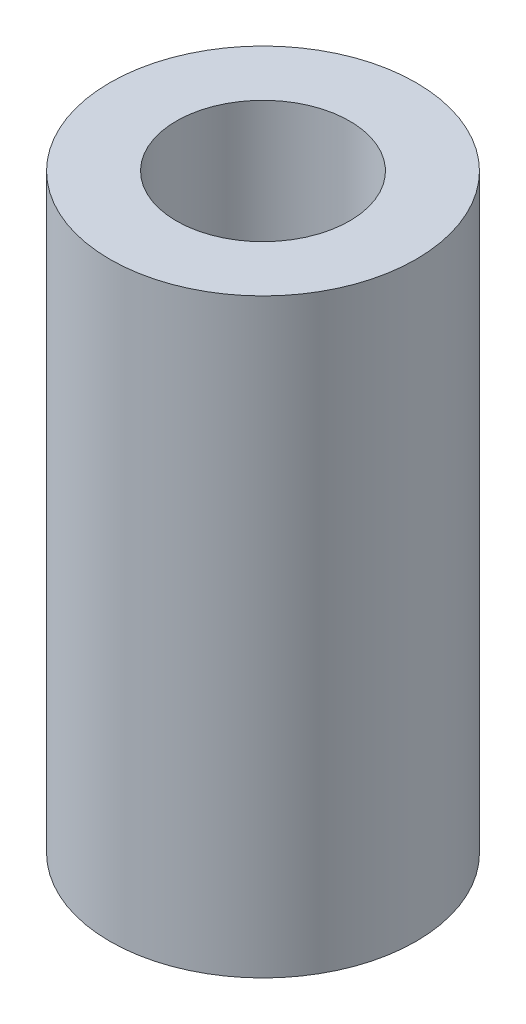
ISO-10303-21;
HEADER;
FILE_DESCRIPTION(('STEP AP214'),'2;1');
FILE_NAME('part.step','',(''),(''),'','','');
FILE_SCHEMA(('AUTOMOTIVE_DESIGN { 1 0 10303 214 1 1 1 1 }'));
ENDSEC;
DATA;
#1=APPLICATION_CONTEXT('core data for automotive mechanical design processes');
#2=APPLICATION_PROTOCOL_DEFINITION('international standard','automotive_design',2000,#1);
#3=PRODUCT_CONTEXT('',#1,'mechanical');
#4=PRODUCT('Part','Part','',(#3));
#5=PRODUCT_RELATED_PRODUCT_CATEGORY('part','',(#4));
#6=PRODUCT_DEFINITION_FORMATION('','',#4);
#7=PRODUCT_DEFINITION_CONTEXT('part definition',#1,'design');
#8=PRODUCT_DEFINITION('design','',#6,#7);
#9=PRODUCT_DEFINITION_SHAPE('','',#8);
#10=(LENGTH_UNIT() NAMED_UNIT(*) SI_UNIT(.MILLI.,.METRE.));
#11=(NAMED_UNIT(*) PLANE_ANGLE_UNIT() SI_UNIT($,.RADIAN.));
#12=(NAMED_UNIT(*) SI_UNIT($,.STERADIAN.) SOLID_ANGLE_UNIT());
#13=UNCERTAINTY_MEASURE_WITH_UNIT(LENGTH_MEASURE(1.E-05),#10,'distance_accuracy_value','');
#14=(GEOMETRIC_REPRESENTATION_CONTEXT(3) GLOBAL_UNCERTAINTY_ASSIGNED_CONTEXT((#13)) GLOBAL_UNIT_ASSIGNED_CONTEXT((#10,
#11,#12)) REPRESENTATION_CONTEXT('',''));
#15=CARTESIAN_POINT('',(0.,0.,0.));
#16=DIRECTION('',(0.,0.,1.));
#17=DIRECTION('',(1.,0.,0.));
#18=AXIS2_PLACEMENT_3D('',#15,#16,#17);
#19=CARTESIAN_POINT('',(0.,48.2364774717357,0.));
#20=DIRECTION('',(0.,-1.,0.));
#21=DIRECTION('',(0.,0.,-1.));
#22=AXIS2_PLACEMENT_3D('',#19,#20,#21);
#23=CYLINDRICAL_SURFACE('',#22,12.5);
#24=CARTESIAN_POINT('',(0.,48.2364774717357,0.));
#25=DIRECTION('',(0.,1.,0.));
#26=DIRECTION('',(0.,0.,1.));
#27=AXIS2_PLACEMENT_3D('',#24,#25,#26);
#28=CIRCLE('',#27,12.5);
#29=CARTESIAN_POINT('',(0.,48.2364774717357,12.5));
#30=VERTEX_POINT('',#29);
#31=EDGE_CURVE('E10',#30,#30,#28,.T.);
#32=ORIENTED_EDGE('',*,*,#31,.F.);
#33=EDGE_LOOP('',(#32));
#34=FACE_BOUND('',#33,.T.);
#35=CARTESIAN_POINT('',(0.,0.,0.));
#36=DIRECTION('',(0.,1.,0.));
#37=DIRECTION('',(0.,0.,1.));
#38=AXIS2_PLACEMENT_3D('',#35,#36,#37);
#39=CIRCLE('',#38,12.5);
#40=CARTESIAN_POINT('',(0.,0.,12.5));
#41=VERTEX_POINT('',#40);
#42=EDGE_CURVE('E37',#41,#41,#39,.T.);
#43=ORIENTED_EDGE('',*,*,#42,.T.);
#44=EDGE_LOOP('',(#43));
#45=FACE_BOUND('',#44,.T.);
#46=ADVANCED_FACE('F40',(#34,#45),#23,.T.);
#47=CARTESIAN_POINT('',(0.,48.2364774717357,0.));
#48=DIRECTION('',(0.,1.,0.));
#49=DIRECTION('',(0.,0.,1.));
#50=AXIS2_PLACEMENT_3D('',#47,#48,#49);
#51=PLANE('',#50);
#52=CARTESIAN_POINT('',(0.,48.2364774717357,0.));
#53=DIRECTION('',(0.,1.,0.));
#54=DIRECTION('',(0.,0.,1.));
#55=AXIS2_PLACEMENT_3D('',#52,#53,#54);
#56=CIRCLE('',#55,7.07393481053782);
#57=CARTESIAN_POINT('',(0.,48.2364774717357,7.07393481053782));
#58=VERTEX_POINT('',#57);
#59=EDGE_CURVE('E50',#58,#58,#56,.T.);
#60=ORIENTED_EDGE('',*,*,#59,.F.);
#61=EDGE_LOOP('',(#60));
#62=FACE_BOUND('',#61,.T.);
#63=ORIENTED_EDGE('',*,*,#31,.T.);
#64=EDGE_LOOP('',(#63));
#65=FACE_BOUND('',#64,.T.);
#66=ADVANCED_FACE('F59',(#62,#65),#51,.T.);
#67=CARTESIAN_POINT('',(0.,0.,0.));
#68=DIRECTION('',(0.,1.,0.));
#69=DIRECTION('',(0.,0.,1.));
#70=AXIS2_PLACEMENT_3D('',#67,#68,#69);
#71=PLANE('',#70);
#72=CARTESIAN_POINT('',(0.,0.,0.));
#73=DIRECTION('',(0.,1.,0.));
#74=DIRECTION('',(0.,0.,1.));
#75=AXIS2_PLACEMENT_3D('',#72,#73,#74);
#76=CIRCLE('',#75,7.07393481053782);
#77=CARTESIAN_POINT('',(0.,0.,7.07393481053782));
#78=VERTEX_POINT('',#77);
#79=EDGE_CURVE('E47',#78,#78,#76,.T.);
#80=ORIENTED_EDGE('',*,*,#79,.T.);
#81=EDGE_LOOP('',(#80));
#82=FACE_BOUND('',#81,.T.);
#83=ORIENTED_EDGE('',*,*,#42,.F.);
#84=EDGE_LOOP('',(#83));
#85=FACE_BOUND('',#84,.T.);
#86=ADVANCED_FACE('F58',(#82,#85),#71,.F.);
#87=CARTESIAN_POINT('',(0.,48.2364774717357,0.));
#88=DIRECTION('',(0.,-1.,0.));
#89=DIRECTION('',(0.,0.,-1.));
#90=AXIS2_PLACEMENT_3D('',#87,#88,#89);
#91=CYLINDRICAL_SURFACE('',#90,7.07393481053782);
#92=ORIENTED_EDGE('',*,*,#59,.T.);
#93=EDGE_LOOP('',(#92));
#94=FACE_BOUND('',#93,.T.);
#95=ORIENTED_EDGE('',*,*,#79,.F.);
#96=EDGE_LOOP('',(#95));
#97=FACE_BOUND('',#96,.T.);
#98=ADVANCED_FACE('F54',(#94,#97),#91,.F.);
#99=CLOSED_SHELL('',(#46,#66,#86,#98));
#100=MANIFOLD_SOLID_BREP('B2',#99);
#101=ADVANCED_BREP_SHAPE_REPRESENTATION('',(#18,#100),#14);
#102=SHAPE_DEFINITION_REPRESENTATION(#9,#101);
ENDSEC;
END-ISO-10303-21;
